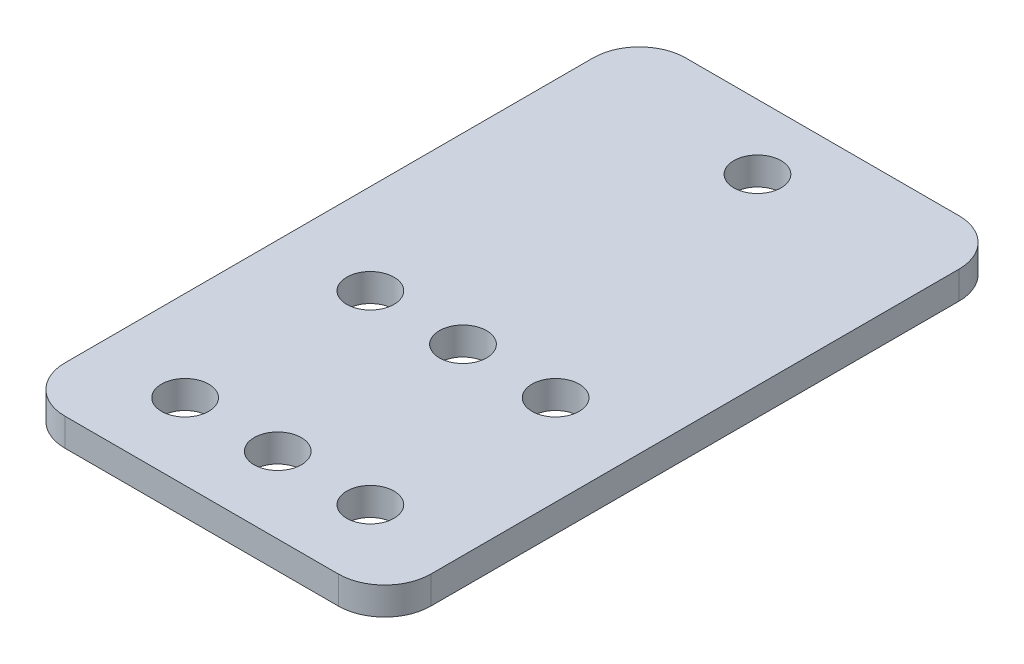
ISO-10303-21;
HEADER;
FILE_DESCRIPTION(('STEP AP214'),'2;1');
FILE_NAME('part.step','',(''),(''),'','','');
FILE_SCHEMA(('AUTOMOTIVE_DESIGN { 1 0 10303 214 1 1 1 1 }'));
ENDSEC;
DATA;
#1=APPLICATION_CONTEXT('core data for automotive mechanical design processes');
#2=APPLICATION_PROTOCOL_DEFINITION('international standard','automotive_design',2000,#1);
#3=PRODUCT_CONTEXT('',#1,'mechanical');
#4=PRODUCT('Part','Part','',(#3));
#5=PRODUCT_RELATED_PRODUCT_CATEGORY('part','',(#4));
#6=PRODUCT_DEFINITION_FORMATION('','',#4);
#7=PRODUCT_DEFINITION_CONTEXT('part definition',#1,'design');
#8=PRODUCT_DEFINITION('design','',#6,#7);
#9=PRODUCT_DEFINITION_SHAPE('','',#8);
#10=(LENGTH_UNIT() NAMED_UNIT(*) SI_UNIT(.MILLI.,.METRE.));
#11=(NAMED_UNIT(*) PLANE_ANGLE_UNIT() SI_UNIT($,.RADIAN.));
#12=(NAMED_UNIT(*) SI_UNIT($,.STERADIAN.) SOLID_ANGLE_UNIT());
#13=UNCERTAINTY_MEASURE_WITH_UNIT(LENGTH_MEASURE(1.E-05),#10,'distance_accuracy_value','');
#14=(GEOMETRIC_REPRESENTATION_CONTEXT(3) GLOBAL_UNCERTAINTY_ASSIGNED_CONTEXT((#13)) GLOBAL_UNIT_ASSIGNED_CONTEXT((#10,
#11,#12)) REPRESENTATION_CONTEXT('',''));
#15=CARTESIAN_POINT('',(0.,0.,0.));
#16=DIRECTION('',(0.,0.,1.));
#17=DIRECTION('',(1.,0.,0.));
#18=AXIS2_PLACEMENT_3D('',#15,#16,#17);
#19=CARTESIAN_POINT('',(-14.75,3.,28.5));
#20=DIRECTION('',(0.,-1.,0.));
#21=DIRECTION('',(0.,0.,-1.));
#22=AXIS2_PLACEMENT_3D('',#19,#20,#21);
#23=PLANE('',#22);
#24=CARTESIAN_POINT('',(-9.99999999999999,3.,25.29));
#25=DIRECTION('',(0.,1.,0.));
#26=DIRECTION('',(0.,0.,1.));
#27=AXIS2_PLACEMENT_3D('',#24,#25,#26);
#28=CIRCLE('',#27,2.55);
#29=CARTESIAN_POINT('',(-9.99999999999999,3.,27.84));
#30=VERTEX_POINT('',#29);
#31=EDGE_CURVE('E207',#30,#30,#28,.T.);
#32=ORIENTED_EDGE('',*,*,#31,.F.);
#33=EDGE_LOOP('',(#32));
#34=FACE_BOUND('',#33,.T.);
#35=CARTESIAN_POINT('',(0.,3.,25.29));
#36=DIRECTION('',(0.,1.,0.));
#37=DIRECTION('',(0.,0.,1.));
#38=AXIS2_PLACEMENT_3D('',#35,#36,#37);
#39=CIRCLE('',#38,2.55);
#40=CARTESIAN_POINT('',(0.,3.,27.84));
#41=VERTEX_POINT('',#40);
#42=EDGE_CURVE('E195',#41,#41,#39,.T.);
#43=ORIENTED_EDGE('',*,*,#42,.F.);
#44=EDGE_LOOP('',(#43));
#45=FACE_BOUND('',#44,.T.);
#46=CARTESIAN_POINT('',(10.,3.,25.29));
#47=DIRECTION('',(0.,1.,0.));
#48=DIRECTION('',(0.,0.,1.));
#49=AXIS2_PLACEMENT_3D('',#46,#47,#48);
#50=CIRCLE('',#49,2.55);
#51=CARTESIAN_POINT('',(10.,3.,27.84));
#52=VERTEX_POINT('',#51);
#53=EDGE_CURVE('E183',#52,#52,#50,.T.);
#54=ORIENTED_EDGE('',*,*,#53,.F.);
#55=EDGE_LOOP('',(#54));
#56=FACE_BOUND('',#55,.T.);
#57=CARTESIAN_POINT('',(-14.75,3.,28.5));
#58=DIRECTION('',(0.,1.,0.));
#59=DIRECTION('',(0.,0.,-1.));
#60=AXIS2_PLACEMENT_3D('',#57,#58,#59);
#61=CIRCLE('',#60,5.);
#62=CARTESIAN_POINT('',(-19.75,3.,28.5));
#63=VERTEX_POINT('',#62);
#64=CARTESIAN_POINT('',(-14.75,3.,33.5));
#65=VERTEX_POINT('',#64);
#66=EDGE_CURVE('E146',#63,#65,#61,.T.);
#67=ORIENTED_EDGE('',*,*,#66,.T.);
#68=DIRECTION('',(1.,0.,0.));
#69=VECTOR('',#68,1.);
#70=CARTESIAN_POINT('',(14.75,3.,33.5));
#71=LINE('',#70,#69);
#72=CARTESIAN_POINT('',(14.75,3.,33.5));
#73=VERTEX_POINT('',#72);
#74=EDGE_CURVE('E94',#65,#73,#71,.T.);
#75=ORIENTED_EDGE('',*,*,#74,.T.);
#76=CARTESIAN_POINT('',(14.75,3.,28.5));
#77=DIRECTION('',(0.,1.,0.));
#78=DIRECTION('',(0.,0.,1.));
#79=AXIS2_PLACEMENT_3D('',#76,#77,#78);
#80=CIRCLE('',#79,5.00000000000001);
#81=CARTESIAN_POINT('',(19.75,3.,28.5));
#82=VERTEX_POINT('',#81);
#83=EDGE_CURVE('E161',#73,#82,#80,.T.);
#84=ORIENTED_EDGE('',*,*,#83,.T.);
#85=DIRECTION('',(0.,0.,-1.));
#86=VECTOR('',#85,1.);
#87=CARTESIAN_POINT('',(19.75,3.,28.5));
#88=LINE('',#87,#86);
#89=CARTESIAN_POINT('',(19.75,3.,-28.5));
#90=VERTEX_POINT('',#89);
#91=EDGE_CURVE('E174',#82,#90,#88,.T.);
#92=ORIENTED_EDGE('',*,*,#91,.T.);
#93=CARTESIAN_POINT('',(14.75,3.,-28.5));
#94=DIRECTION('',(0.,1.,0.));
#95=DIRECTION('',(0.,0.,1.));
#96=AXIS2_PLACEMENT_3D('',#93,#94,#95);
#97=CIRCLE('',#96,5.);
#98=CARTESIAN_POINT('',(14.75,3.,-33.5));
#99=VERTEX_POINT('',#98);
#100=EDGE_CURVE('E113',#90,#99,#97,.T.);
#101=ORIENTED_EDGE('',*,*,#100,.T.);
#102=DIRECTION('',(-1.,0.,0.));
#103=VECTOR('',#102,1.);
#104=CARTESIAN_POINT('',(14.75,3.,-33.5));
#105=LINE('',#104,#103);
#106=CARTESIAN_POINT('',(-14.75,3.,-33.5));
#107=VERTEX_POINT('',#106);
#108=EDGE_CURVE('E107',#99,#107,#105,.T.);
#109=ORIENTED_EDGE('',*,*,#108,.T.);
#110=CARTESIAN_POINT('',(-14.75,3.,-28.5));
#111=DIRECTION('',(0.,1.,0.));
#112=DIRECTION('',(0.,0.,1.));
#113=AXIS2_PLACEMENT_3D('',#110,#111,#112);
#114=CIRCLE('',#113,5.);
#115=CARTESIAN_POINT('',(-19.75,3.,-28.5));
#116=VERTEX_POINT('',#115);
#117=EDGE_CURVE('E111',#107,#116,#114,.T.);
#118=ORIENTED_EDGE('',*,*,#117,.T.);
#119=DIRECTION('',(0.,0.,1.));
#120=VECTOR('',#119,1.);
#121=CARTESIAN_POINT('',(-19.75,3.,28.5));
#122=LINE('',#121,#120);
#123=EDGE_CURVE('E51',#116,#63,#122,.T.);
#124=ORIENTED_EDGE('',*,*,#123,.T.);
#125=EDGE_LOOP('',(#67,#75,#84,#92,#101,#109,#118,#124));
#126=FACE_BOUND('',#125,.T.);
#127=CARTESIAN_POINT('',(0.,3.,-26.5));
#128=DIRECTION('',(0.,1.,0.));
#129=DIRECTION('',(0.,0.,1.));
#130=AXIS2_PLACEMENT_3D('',#127,#128,#129);
#131=CIRCLE('',#130,2.55);
#132=CARTESIAN_POINT('',(0.,3.,-23.95));
#133=VERTEX_POINT('',#132);
#134=EDGE_CURVE('E135',#133,#133,#131,.T.);
#135=ORIENTED_EDGE('',*,*,#134,.F.);
#136=EDGE_LOOP('',(#135));
#137=FACE_BOUND('',#136,.T.);
#138=CARTESIAN_POINT('',(10.,3.,5.29));
#139=DIRECTION('',(0.,1.,0.));
#140=DIRECTION('',(0.,0.,1.));
#141=AXIS2_PLACEMENT_3D('',#138,#139,#140);
#142=CIRCLE('',#141,2.55);
#143=CARTESIAN_POINT('',(10.,3.,7.84));
#144=VERTEX_POINT('',#143);
#145=EDGE_CURVE('E189',#144,#144,#142,.T.);
#146=ORIENTED_EDGE('',*,*,#145,.F.);
#147=EDGE_LOOP('',(#146));
#148=FACE_BOUND('',#147,.T.);
#149=CARTESIAN_POINT('',(0.,3.,5.29));
#150=DIRECTION('',(0.,1.,0.));
#151=DIRECTION('',(0.,0.,1.));
#152=AXIS2_PLACEMENT_3D('',#149,#150,#151);
#153=CIRCLE('',#152,2.55);
#154=CARTESIAN_POINT('',(0.,3.,7.84));
#155=VERTEX_POINT('',#154);
#156=EDGE_CURVE('E201',#155,#155,#153,.T.);
#157=ORIENTED_EDGE('',*,*,#156,.F.);
#158=EDGE_LOOP('',(#157));
#159=FACE_BOUND('',#158,.T.);
#160=CARTESIAN_POINT('',(-9.99999999999999,3.,5.29));
#161=DIRECTION('',(0.,1.,0.));
#162=DIRECTION('',(0.,0.,1.));
#163=AXIS2_PLACEMENT_3D('',#160,#161,#162);
#164=CIRCLE('',#163,2.55);
#165=CARTESIAN_POINT('',(-9.99999999999999,3.,7.84));
#166=VERTEX_POINT('',#165);
#167=EDGE_CURVE('E213',#166,#166,#164,.T.);
#168=ORIENTED_EDGE('',*,*,#167,.F.);
#169=EDGE_LOOP('',(#168));
#170=FACE_BOUND('',#169,.T.);
#171=ADVANCED_FACE('F34',(#34,#45,#56,#126,#137,#148,#159,#170),#23,.F.);
#172=CARTESIAN_POINT('',(-14.75,0.,28.5));
#173=DIRECTION('',(0.,-1.,0.));
#174=DIRECTION('',(0.,0.,-1.));
#175=AXIS2_PLACEMENT_3D('',#172,#173,#174);
#176=PLANE('',#175);
#177=CARTESIAN_POINT('',(-9.99999999999999,0.,25.29));
#178=DIRECTION('',(0.,1.,0.));
#179=DIRECTION('',(0.,0.,1.));
#180=AXIS2_PLACEMENT_3D('',#177,#178,#179);
#181=CIRCLE('',#180,2.55);
#182=CARTESIAN_POINT('',(-9.99999999999999,0.,27.84));
#183=VERTEX_POINT('',#182);
#184=EDGE_CURVE('E210',#183,#183,#181,.T.);
#185=ORIENTED_EDGE('',*,*,#184,.T.);
#186=EDGE_LOOP('',(#185));
#187=FACE_BOUND('',#186,.T.);
#188=CARTESIAN_POINT('',(0.,0.,25.29));
#189=DIRECTION('',(0.,1.,0.));
#190=DIRECTION('',(0.,0.,1.));
#191=AXIS2_PLACEMENT_3D('',#188,#189,#190);
#192=CIRCLE('',#191,2.55);
#193=CARTESIAN_POINT('',(0.,0.,27.84));
#194=VERTEX_POINT('',#193);
#195=EDGE_CURVE('E198',#194,#194,#192,.T.);
#196=ORIENTED_EDGE('',*,*,#195,.T.);
#197=EDGE_LOOP('',(#196));
#198=FACE_BOUND('',#197,.T.);
#199=CARTESIAN_POINT('',(10.,0.,25.29));
#200=DIRECTION('',(0.,1.,0.));
#201=DIRECTION('',(0.,0.,1.));
#202=AXIS2_PLACEMENT_3D('',#199,#200,#201);
#203=CIRCLE('',#202,2.55);
#204=CARTESIAN_POINT('',(10.,0.,27.84));
#205=VERTEX_POINT('',#204);
#206=EDGE_CURVE('E186',#205,#205,#203,.T.);
#207=ORIENTED_EDGE('',*,*,#206,.T.);
#208=EDGE_LOOP('',(#207));
#209=FACE_BOUND('',#208,.T.);
#210=CARTESIAN_POINT('',(-14.75,0.,28.5));
#211=DIRECTION('',(0.,1.,0.));
#212=DIRECTION('',(0.,0.,-1.));
#213=AXIS2_PLACEMENT_3D('',#210,#211,#212);
#214=CIRCLE('',#213,5.);
#215=CARTESIAN_POINT('',(-19.75,0.,28.5));
#216=VERTEX_POINT('',#215);
#217=CARTESIAN_POINT('',(-14.75,0.,33.5));
#218=VERTEX_POINT('',#217);
#219=EDGE_CURVE('E131',#216,#218,#214,.T.);
#220=ORIENTED_EDGE('',*,*,#219,.F.);
#221=DIRECTION('',(0.,0.,1.));
#222=VECTOR('',#221,1.);
#223=CARTESIAN_POINT('',(-19.75,0.,28.5));
#224=LINE('',#223,#222);
#225=CARTESIAN_POINT('',(-19.75,0.,-28.5));
#226=VERTEX_POINT('',#225);
#227=EDGE_CURVE('E86',#226,#216,#224,.T.);
#228=ORIENTED_EDGE('',*,*,#227,.F.);
#229=CARTESIAN_POINT('',(-14.75,0.,-28.5));
#230=DIRECTION('',(0.,1.,0.));
#231=DIRECTION('',(0.,0.,1.));
#232=AXIS2_PLACEMENT_3D('',#229,#230,#231);
#233=CIRCLE('',#232,5.);
#234=CARTESIAN_POINT('',(-14.75,0.,-33.5));
#235=VERTEX_POINT('',#234);
#236=EDGE_CURVE('E80',#235,#226,#233,.T.);
#237=ORIENTED_EDGE('',*,*,#236,.F.);
#238=DIRECTION('',(-1.,0.,0.));
#239=VECTOR('',#238,1.);
#240=CARTESIAN_POINT('',(14.75,0.,-33.5));
#241=LINE('',#240,#239);
#242=CARTESIAN_POINT('',(14.75,0.,-33.5));
#243=VERTEX_POINT('',#242);
#244=EDGE_CURVE('E121',#243,#235,#241,.T.);
#245=ORIENTED_EDGE('',*,*,#244,.F.);
#246=CARTESIAN_POINT('',(14.75,0.,-28.5));
#247=DIRECTION('',(0.,1.,0.));
#248=DIRECTION('',(0.,0.,1.));
#249=AXIS2_PLACEMENT_3D('',#246,#247,#248);
#250=CIRCLE('',#249,5.);
#251=CARTESIAN_POINT('',(19.75,0.,-28.5));
#252=VERTEX_POINT('',#251);
#253=EDGE_CURVE('E141',#252,#243,#250,.T.);
#254=ORIENTED_EDGE('',*,*,#253,.F.);
#255=DIRECTION('',(0.,0.,-1.));
#256=VECTOR('',#255,1.);
#257=CARTESIAN_POINT('',(19.75,0.,28.5));
#258=LINE('',#257,#256);
#259=CARTESIAN_POINT('',(19.75,0.,28.5));
#260=VERTEX_POINT('',#259);
#261=EDGE_CURVE('E139',#260,#252,#258,.T.);
#262=ORIENTED_EDGE('',*,*,#261,.F.);
#263=CARTESIAN_POINT('',(14.75,0.,28.5));
#264=DIRECTION('',(0.,1.,0.));
#265=DIRECTION('',(0.,0.,1.));
#266=AXIS2_PLACEMENT_3D('',#263,#264,#265);
#267=CIRCLE('',#266,5.00000000000001);
#268=CARTESIAN_POINT('',(14.75,0.,33.5));
#269=VERTEX_POINT('',#268);
#270=EDGE_CURVE('E137',#269,#260,#267,.T.);
#271=ORIENTED_EDGE('',*,*,#270,.F.);
#272=DIRECTION('',(1.,0.,0.));
#273=VECTOR('',#272,1.);
#274=CARTESIAN_POINT('',(14.75,0.,33.5));
#275=LINE('',#274,#273);
#276=EDGE_CURVE('E134',#218,#269,#275,.T.);
#277=ORIENTED_EDGE('',*,*,#276,.F.);
#278=EDGE_LOOP('',(#220,#228,#237,#245,#254,#262,#271,#277));
#279=FACE_BOUND('',#278,.T.);
#280=CARTESIAN_POINT('',(0.,0.,-26.5));
#281=DIRECTION('',(0.,1.,0.));
#282=DIRECTION('',(0.,0.,1.));
#283=AXIS2_PLACEMENT_3D('',#280,#281,#282);
#284=CIRCLE('',#283,2.55);
#285=CARTESIAN_POINT('',(0.,0.,-23.95));
#286=VERTEX_POINT('',#285);
#287=EDGE_CURVE('E180',#286,#286,#284,.T.);
#288=ORIENTED_EDGE('',*,*,#287,.T.);
#289=EDGE_LOOP('',(#288));
#290=FACE_BOUND('',#289,.T.);
#291=CARTESIAN_POINT('',(10.,0.,5.29));
#292=DIRECTION('',(0.,1.,0.));
#293=DIRECTION('',(0.,0.,1.));
#294=AXIS2_PLACEMENT_3D('',#291,#292,#293);
#295=CIRCLE('',#294,2.55);
#296=CARTESIAN_POINT('',(10.,0.,7.84));
#297=VERTEX_POINT('',#296);
#298=EDGE_CURVE('E192',#297,#297,#295,.T.);
#299=ORIENTED_EDGE('',*,*,#298,.T.);
#300=EDGE_LOOP('',(#299));
#301=FACE_BOUND('',#300,.T.);
#302=CARTESIAN_POINT('',(0.,0.,5.29));
#303=DIRECTION('',(0.,1.,0.));
#304=DIRECTION('',(0.,0.,1.));
#305=AXIS2_PLACEMENT_3D('',#302,#303,#304);
#306=CIRCLE('',#305,2.55);
#307=CARTESIAN_POINT('',(0.,0.,7.84));
#308=VERTEX_POINT('',#307);
#309=EDGE_CURVE('E204',#308,#308,#306,.T.);
#310=ORIENTED_EDGE('',*,*,#309,.T.);
#311=EDGE_LOOP('',(#310));
#312=FACE_BOUND('',#311,.T.);
#313=CARTESIAN_POINT('',(-9.99999999999999,0.,5.29));
#314=DIRECTION('',(0.,1.,0.));
#315=DIRECTION('',(0.,0.,1.));
#316=AXIS2_PLACEMENT_3D('',#313,#314,#315);
#317=CIRCLE('',#316,2.55);
#318=CARTESIAN_POINT('',(-9.99999999999999,0.,7.84));
#319=VERTEX_POINT('',#318);
#320=EDGE_CURVE('E216',#319,#319,#317,.T.);
#321=ORIENTED_EDGE('',*,*,#320,.T.);
#322=EDGE_LOOP('',(#321));
#323=FACE_BOUND('',#322,.T.);
#324=ADVANCED_FACE('F165',(#187,#198,#209,#279,#290,#301,#312,#323),#176,.T.);
#325=CARTESIAN_POINT('',(-14.75,3.,28.5));
#326=DIRECTION('',(0.,-1.,0.));
#327=DIRECTION('',(0.,0.,-1.));
#328=AXIS2_PLACEMENT_3D('',#325,#326,#327);
#329=CYLINDRICAL_SURFACE('',#328,5.);
#330=ORIENTED_EDGE('',*,*,#219,.T.);
#331=DIRECTION('',(0.,-1.,0.));
#332=VECTOR('',#331,1.);
#333=CARTESIAN_POINT('',(-14.75,3.,33.5));
#334=LINE('',#333,#332);
#335=EDGE_CURVE('E11',#65,#218,#334,.T.);
#336=ORIENTED_EDGE('',*,*,#335,.F.);
#337=ORIENTED_EDGE('',*,*,#66,.F.);
#338=DIRECTION('',(0.,-1.,0.));
#339=VECTOR('',#338,1.);
#340=CARTESIAN_POINT('',(-19.75,3.,28.5));
#341=LINE('',#340,#339);
#342=EDGE_CURVE('E127',#63,#216,#341,.T.);
#343=ORIENTED_EDGE('',*,*,#342,.T.);
#344=EDGE_LOOP('',(#330,#336,#337,#343));
#345=FACE_BOUND('',#344,.T.);
#346=ADVANCED_FACE('F36',(#345),#329,.T.);
#347=CARTESIAN_POINT('',(14.75,3.,33.5));
#348=DIRECTION('',(0.,0.,-1.));
#349=DIRECTION('',(-1.,0.,0.));
#350=AXIS2_PLACEMENT_3D('',#347,#348,#349);
#351=PLANE('',#350);
#352=ORIENTED_EDGE('',*,*,#276,.T.);
#353=DIRECTION('',(0.,-1.,0.));
#354=VECTOR('',#353,1.);
#355=CARTESIAN_POINT('',(14.75,3.,33.5));
#356=LINE('',#355,#354);
#357=EDGE_CURVE('E43',#73,#269,#356,.T.);
#358=ORIENTED_EDGE('',*,*,#357,.F.);
#359=ORIENTED_EDGE('',*,*,#74,.F.);
#360=ORIENTED_EDGE('',*,*,#335,.T.);
#361=EDGE_LOOP('',(#352,#358,#359,#360));
#362=FACE_BOUND('',#361,.T.);
#363=ADVANCED_FACE('F251',(#362),#351,.F.);
#364=CARTESIAN_POINT('',(14.75,3.,28.5));
#365=DIRECTION('',(0.,-1.,0.));
#366=DIRECTION('',(0.,0.,-1.));
#367=AXIS2_PLACEMENT_3D('',#364,#365,#366);
#368=CYLINDRICAL_SURFACE('',#367,5.00000000000001);
#369=ORIENTED_EDGE('',*,*,#270,.T.);
#370=DIRECTION('',(0.,-1.,0.));
#371=VECTOR('',#370,1.);
#372=CARTESIAN_POINT('',(19.75,3.,28.5));
#373=LINE('',#372,#371);
#374=EDGE_CURVE('E153',#82,#260,#373,.T.);
#375=ORIENTED_EDGE('',*,*,#374,.F.);
#376=ORIENTED_EDGE('',*,*,#83,.F.);
#377=ORIENTED_EDGE('',*,*,#357,.T.);
#378=EDGE_LOOP('',(#369,#375,#376,#377));
#379=FACE_BOUND('',#378,.T.);
#380=ADVANCED_FACE('F159',(#379),#368,.T.);
#381=CARTESIAN_POINT('',(19.75,3.,28.5));
#382=DIRECTION('',(-1.,0.,0.));
#383=DIRECTION('',(0.,0.,1.));
#384=AXIS2_PLACEMENT_3D('',#381,#382,#383);
#385=PLANE('',#384);
#386=ORIENTED_EDGE('',*,*,#261,.T.);
#387=DIRECTION('',(0.,-1.,0.));
#388=VECTOR('',#387,1.);
#389=CARTESIAN_POINT('',(19.75,3.,-28.5));
#390=LINE('',#389,#388);
#391=EDGE_CURVE('E150',#90,#252,#390,.T.);
#392=ORIENTED_EDGE('',*,*,#391,.F.);
#393=ORIENTED_EDGE('',*,*,#91,.F.);
#394=ORIENTED_EDGE('',*,*,#374,.T.);
#395=EDGE_LOOP('',(#386,#392,#393,#394));
#396=FACE_BOUND('',#395,.T.);
#397=ADVANCED_FACE('F170',(#396),#385,.F.);
#398=CARTESIAN_POINT('',(14.75,3.,-28.5));
#399=DIRECTION('',(0.,-1.,0.));
#400=DIRECTION('',(0.,0.,-1.));
#401=AXIS2_PLACEMENT_3D('',#398,#399,#400);
#402=CYLINDRICAL_SURFACE('',#401,5.);
#403=ORIENTED_EDGE('',*,*,#253,.T.);
#404=DIRECTION('',(0.,-1.,0.));
#405=VECTOR('',#404,1.);
#406=CARTESIAN_POINT('',(14.75,3.,-33.5));
#407=LINE('',#406,#405);
#408=EDGE_CURVE('E122',#99,#243,#407,.T.);
#409=ORIENTED_EDGE('',*,*,#408,.F.);
#410=ORIENTED_EDGE('',*,*,#100,.F.);
#411=ORIENTED_EDGE('',*,*,#391,.T.);
#412=EDGE_LOOP('',(#403,#409,#410,#411));
#413=FACE_BOUND('',#412,.T.);
#414=ADVANCED_FACE('F173',(#413),#402,.T.);
#415=CARTESIAN_POINT('',(14.75,3.,-33.5));
#416=DIRECTION('',(0.,0.,1.));
#417=DIRECTION('',(1.,0.,0.));
#418=AXIS2_PLACEMENT_3D('',#415,#416,#417);
#419=PLANE('',#418);
#420=ORIENTED_EDGE('',*,*,#244,.T.);
#421=DIRECTION('',(0.,-1.,0.));
#422=VECTOR('',#421,1.);
#423=CARTESIAN_POINT('',(-14.75,3.,-33.5));
#424=LINE('',#423,#422);
#425=EDGE_CURVE('E118',#107,#235,#424,.T.);
#426=ORIENTED_EDGE('',*,*,#425,.F.);
#427=ORIENTED_EDGE('',*,*,#108,.F.);
#428=ORIENTED_EDGE('',*,*,#408,.T.);
#429=EDGE_LOOP('',(#420,#426,#427,#428));
#430=FACE_BOUND('',#429,.T.);
#431=ADVANCED_FACE('F119',(#430),#419,.F.);
#432=CARTESIAN_POINT('',(-14.75,3.,-28.5));
#433=DIRECTION('',(0.,-1.,0.));
#434=DIRECTION('',(0.,0.,-1.));
#435=AXIS2_PLACEMENT_3D('',#432,#433,#434);
#436=CYLINDRICAL_SURFACE('',#435,5.);
#437=ORIENTED_EDGE('',*,*,#236,.T.);
#438=DIRECTION('',(0.,-1.,0.));
#439=VECTOR('',#438,1.);
#440=CARTESIAN_POINT('',(-19.75,3.,-28.5));
#441=LINE('',#440,#439);
#442=EDGE_CURVE('E123',#116,#226,#441,.T.);
#443=ORIENTED_EDGE('',*,*,#442,.F.);
#444=ORIENTED_EDGE('',*,*,#117,.F.);
#445=ORIENTED_EDGE('',*,*,#425,.T.);
#446=EDGE_LOOP('',(#437,#443,#444,#445));
#447=FACE_BOUND('',#446,.T.);
#448=ADVANCED_FACE('F125',(#447),#436,.T.);
#449=CARTESIAN_POINT('',(-19.75,3.,28.5));
#450=DIRECTION('',(1.,0.,0.));
#451=DIRECTION('',(0.,0.,-1.));
#452=AXIS2_PLACEMENT_3D('',#449,#450,#451);
#453=PLANE('',#452);
#454=ORIENTED_EDGE('',*,*,#227,.T.);
#455=ORIENTED_EDGE('',*,*,#342,.F.);
#456=ORIENTED_EDGE('',*,*,#123,.F.);
#457=ORIENTED_EDGE('',*,*,#442,.T.);
#458=EDGE_LOOP('',(#454,#455,#456,#457));
#459=FACE_BOUND('',#458,.T.);
#460=ADVANCED_FACE('F239',(#459),#453,.F.);
#461=CARTESIAN_POINT('',(0.,3.,-26.5));
#462=DIRECTION('',(0.,-1.,0.));
#463=DIRECTION('',(0.,0.,-1.));
#464=AXIS2_PLACEMENT_3D('',#461,#462,#463);
#465=CYLINDRICAL_SURFACE('',#464,2.55);
#466=ORIENTED_EDGE('',*,*,#134,.T.);
#467=EDGE_LOOP('',(#466));
#468=FACE_BOUND('',#467,.T.);
#469=ORIENTED_EDGE('',*,*,#287,.F.);
#470=EDGE_LOOP('',(#469));
#471=FACE_BOUND('',#470,.T.);
#472=ADVANCED_FACE('F236',(#468,#471),#465,.F.);
#473=CARTESIAN_POINT('',(10.,3.,25.29));
#474=DIRECTION('',(0.,-1.,0.));
#475=DIRECTION('',(0.,0.,-1.));
#476=AXIS2_PLACEMENT_3D('',#473,#474,#475);
#477=CYLINDRICAL_SURFACE('',#476,2.55);
#478=ORIENTED_EDGE('',*,*,#53,.T.);
#479=EDGE_LOOP('',(#478));
#480=FACE_BOUND('',#479,.T.);
#481=ORIENTED_EDGE('',*,*,#206,.F.);
#482=EDGE_LOOP('',(#481));
#483=FACE_BOUND('',#482,.T.);
#484=ADVANCED_FACE('F315',(#480,#483),#477,.F.);
#485=CARTESIAN_POINT('',(10.,3.,5.29));
#486=DIRECTION('',(0.,-1.,0.));
#487=DIRECTION('',(0.,0.,-1.));
#488=AXIS2_PLACEMENT_3D('',#485,#486,#487);
#489=CYLINDRICAL_SURFACE('',#488,2.55);
#490=ORIENTED_EDGE('',*,*,#145,.T.);
#491=EDGE_LOOP('',(#490));
#492=FACE_BOUND('',#491,.T.);
#493=ORIENTED_EDGE('',*,*,#298,.F.);
#494=EDGE_LOOP('',(#493));
#495=FACE_BOUND('',#494,.T.);
#496=ADVANCED_FACE('F323',(#492,#495),#489,.F.);
#497=CARTESIAN_POINT('',(0.,3.,25.29));
#498=DIRECTION('',(0.,-1.,0.));
#499=DIRECTION('',(0.,0.,-1.));
#500=AXIS2_PLACEMENT_3D('',#497,#498,#499);
#501=CYLINDRICAL_SURFACE('',#500,2.55);
#502=ORIENTED_EDGE('',*,*,#42,.T.);
#503=EDGE_LOOP('',(#502));
#504=FACE_BOUND('',#503,.T.);
#505=ORIENTED_EDGE('',*,*,#195,.F.);
#506=EDGE_LOOP('',(#505));
#507=FACE_BOUND('',#506,.T.);
#508=ADVANCED_FACE('F331',(#504,#507),#501,.F.);
#509=CARTESIAN_POINT('',(0.,3.,5.29));
#510=DIRECTION('',(0.,-1.,0.));
#511=DIRECTION('',(0.,0.,-1.));
#512=AXIS2_PLACEMENT_3D('',#509,#510,#511);
#513=CYLINDRICAL_SURFACE('',#512,2.55);
#514=ORIENTED_EDGE('',*,*,#156,.T.);
#515=EDGE_LOOP('',(#514));
#516=FACE_BOUND('',#515,.T.);
#517=ORIENTED_EDGE('',*,*,#309,.F.);
#518=EDGE_LOOP('',(#517));
#519=FACE_BOUND('',#518,.T.);
#520=ADVANCED_FACE('F340',(#516,#519),#513,.F.);
#521=CARTESIAN_POINT('',(-9.99999999999999,3.,25.29));
#522=DIRECTION('',(0.,-1.,0.));
#523=DIRECTION('',(0.,0.,-1.));
#524=AXIS2_PLACEMENT_3D('',#521,#522,#523);
#525=CYLINDRICAL_SURFACE('',#524,2.55);
#526=ORIENTED_EDGE('',*,*,#31,.T.);
#527=EDGE_LOOP('',(#526));
#528=FACE_BOUND('',#527,.T.);
#529=ORIENTED_EDGE('',*,*,#184,.F.);
#530=EDGE_LOOP('',(#529));
#531=FACE_BOUND('',#530,.T.);
#532=ADVANCED_FACE('F349',(#528,#531),#525,.F.);
#533=CARTESIAN_POINT('',(-9.99999999999999,3.,5.29));
#534=DIRECTION('',(0.,-1.,0.));
#535=DIRECTION('',(0.,0.,-1.));
#536=AXIS2_PLACEMENT_3D('',#533,#534,#535);
#537=CYLINDRICAL_SURFACE('',#536,2.55);
#538=ORIENTED_EDGE('',*,*,#167,.T.);
#539=EDGE_LOOP('',(#538));
#540=FACE_BOUND('',#539,.T.);
#541=ORIENTED_EDGE('',*,*,#320,.F.);
#542=EDGE_LOOP('',(#541));
#543=FACE_BOUND('',#542,.T.);
#544=ADVANCED_FACE('F222',(#540,#543),#537,.F.);
#545=CLOSED_SHELL('',(#171,#324,#346,#363,#380,#397,#414,#431,#448,#460,#472,#484,#496,#508,
#520,#532,#544));
#546=MANIFOLD_SOLID_BREP('B2',#545);
#547=ADVANCED_BREP_SHAPE_REPRESENTATION('',(#18,#546),#14);
#548=SHAPE_DEFINITION_REPRESENTATION(#9,#547);
ENDSEC;
END-ISO-10303-21;
